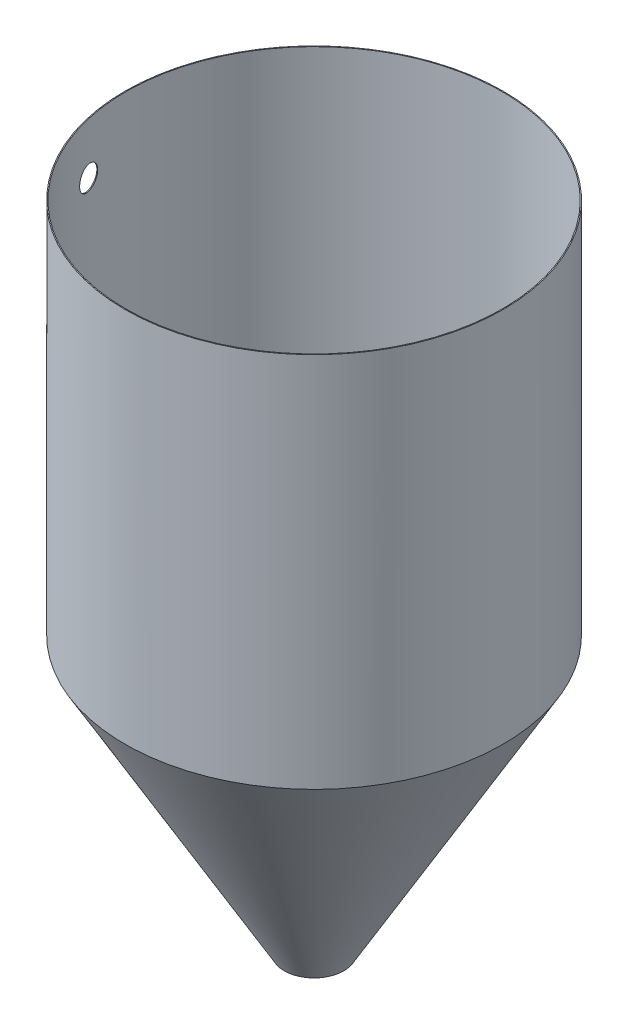
ISO-10303-21;
HEADER;
FILE_DESCRIPTION(('STEP AP214'),'2;1');
FILE_NAME('part.step','',(''),(''),'','','');
FILE_SCHEMA(('AUTOMOTIVE_DESIGN { 1 0 10303 214 1 1 1 1 }'));
ENDSEC;
DATA;
#1=APPLICATION_CONTEXT('core data for automotive mechanical design processes');
#2=APPLICATION_PROTOCOL_DEFINITION('international standard','automotive_design',2000,#1);
#3=PRODUCT_CONTEXT('',#1,'mechanical');
#4=PRODUCT('Part','Part','',(#3));
#5=PRODUCT_RELATED_PRODUCT_CATEGORY('part','',(#4));
#6=PRODUCT_DEFINITION_FORMATION('','',#4);
#7=PRODUCT_DEFINITION_CONTEXT('part definition',#1,'design');
#8=PRODUCT_DEFINITION('design','',#6,#7);
#9=PRODUCT_DEFINITION_SHAPE('','',#8);
#10=(LENGTH_UNIT() NAMED_UNIT(*) SI_UNIT(.MILLI.,.METRE.));
#11=(NAMED_UNIT(*) PLANE_ANGLE_UNIT() SI_UNIT($,.RADIAN.));
#12=(NAMED_UNIT(*) SI_UNIT($,.STERADIAN.) SOLID_ANGLE_UNIT());
#13=UNCERTAINTY_MEASURE_WITH_UNIT(LENGTH_MEASURE(1.E-05),#10,'distance_accuracy_value','');
#14=(GEOMETRIC_REPRESENTATION_CONTEXT(3) GLOBAL_UNCERTAINTY_ASSIGNED_CONTEXT((#13)) GLOBAL_UNIT_ASSIGNED_CONTEXT((#10,
#11,#12)) REPRESENTATION_CONTEXT('',''));
#15=CARTESIAN_POINT('',(0.,0.,0.));
#16=DIRECTION('',(0.,0.,1.));
#17=DIRECTION('',(1.,0.,0.));
#18=AXIS2_PLACEMENT_3D('',#15,#16,#17);
#19=CARTESIAN_POINT('',(0.,508.,0.));
#20=DIRECTION('',(0.,1.,0.));
#21=DIRECTION('',(0.,0.,1.));
#22=AXIS2_PLACEMENT_3D('',#19,#20,#21);
#23=PLANE('',#22);
#24=CARTESIAN_POINT('',(0.,508.,0.));
#25=DIRECTION('',(0.,1.,0.));
#26=DIRECTION('',(0.,0.,1.));
#27=AXIS2_PLACEMENT_3D('',#24,#25,#26);
#28=CIRCLE('',#27,255.21412);
#29=CARTESIAN_POINT('',(0.,508.,255.21412));
#30=VERTEX_POINT('',#29);
#31=EDGE_CURVE('E10',#30,#30,#28,.T.);
#32=ORIENTED_EDGE('',*,*,#31,.T.);
#33=EDGE_LOOP('',(#32));
#34=FACE_BOUND('',#33,.T.);
#35=CARTESIAN_POINT('',(0.,508.,0.));
#36=DIRECTION('',(0.,1.,0.));
#37=DIRECTION('',(0.,0.,1.));
#38=AXIS2_PLACEMENT_3D('',#35,#36,#37);
#39=CIRCLE('',#38,254.);
#40=CARTESIAN_POINT('',(0.,508.,254.));
#41=VERTEX_POINT('',#40);
#42=EDGE_CURVE('E45',#41,#41,#39,.T.);
#43=ORIENTED_EDGE('',*,*,#42,.F.);
#44=EDGE_LOOP('',(#43));
#45=FACE_BOUND('',#44,.T.);
#46=ADVANCED_FACE('F32',(#34,#45),#23,.T.);
#47=CARTESIAN_POINT('',(0.,508.,0.));
#48=DIRECTION('',(0.,-1.,0.));
#49=DIRECTION('',(0.,0.,-1.));
#50=AXIS2_PLACEMENT_3D('',#47,#48,#49);
#51=CYLINDRICAL_SURFACE('',#50,255.21412);
#52=CARTESIAN_POINT('',(-251.85436550192,438.955800527484,41.2749999999982));
#53=CARTESIAN_POINT('',(-251.854365706836,439.396988773429,41.2749963903755));
#54=CARTESIAN_POINT('',(-251.851351997081,439.838120880812,41.2933999942924));
#55=CARTESIAN_POINT('',(-251.839294482292,440.717381843675,41.366873648681));
#56=CARTESIAN_POINT('',(-251.830249127135,441.155509897869,41.4219531247799));
#57=CARTESIAN_POINT('',(-251.806109775557,442.025942254381,41.5684449986926));
#58=CARTESIAN_POINT('',(-251.791009478479,442.458240003938,41.6598952424156));
#59=CARTESIAN_POINT('',(-251.754755714358,443.31347619577,41.8784225878516));
#60=CARTESIAN_POINT('',(-251.733602252212,443.736414645617,42.0054996607384));
#61=CARTESIAN_POINT('',(-251.685256719372,444.569652603928,42.2942074638002));
#62=CARTESIAN_POINT('',(-251.658068703428,444.979960389407,42.4558149894848));
#63=CARTESIAN_POINT('',(-251.597651353186,445.785353594374,42.8123996030711));
#64=CARTESIAN_POINT('',(-251.564421931942,446.180438794684,43.007377171225));
#65=CARTESIAN_POINT('',(-251.491949764181,446.952528174313,43.4291607372981));
#66=CARTESIAN_POINT('',(-251.452708524765,447.329536854211,43.6559587569664));
#67=CARTESIAN_POINT('',(-251.368244219134,448.06297915449,44.1396998556211));
#68=CARTESIAN_POINT('',(-251.323021153745,448.419412777706,44.3966429304508));
#69=CARTESIAN_POINT('',(-251.226445745128,449.110784629897,44.9399201909252));
#70=CARTESIAN_POINT('',(-251.175067578278,449.445622536398,45.226377446369));
#71=CARTESIAN_POINT('',(-251.066435529356,450.089842065177,45.8255898343259));
#72=CARTESIAN_POINT('',(-251.009181635539,450.399223636564,46.1383450194102));
#73=CARTESIAN_POINT('',(-250.888927640438,450.990507387284,46.7878412552311));
#74=CARTESIAN_POINT('',(-250.825927175589,451.272407825649,47.1245838232661));
#75=CARTESIAN_POINT('',(-250.694359883361,451.806894985451,47.8195569006754));
#76=CARTESIAN_POINT('',(-250.625793006625,452.059481446919,48.1777876005734));
#77=CARTESIAN_POINT('',(-250.482424581402,452.536737574496,48.917745131333));
#78=CARTESIAN_POINT('',(-250.407555665985,452.761017699249,49.2997101633119));
#79=CARTESIAN_POINT('',(-250.252629844539,453.176526030377,50.0802014590353));
#80=CARTESIAN_POINT('',(-250.172572904496,453.367754020023,50.4787278313549));
#81=CARTESIAN_POINT('',(-250.007611075412,453.71604493981,51.2894977769892));
#82=CARTESIAN_POINT('',(-249.922705875292,453.873105674562,51.7017422297867));
#83=CARTESIAN_POINT('',(-249.748456090782,454.1521775431,52.5370129861681));
#84=CARTESIAN_POINT('',(-249.659111452128,454.27418824834,52.9600394215104));
#85=CARTESIAN_POINT('',(-249.474697032608,454.484529975382,53.8221196023577));
#86=CARTESIAN_POINT('',(-249.379550408639,454.572171764533,54.2613251396481));
#87=CARTESIAN_POINT('',(-249.185680578746,454.709995403622,55.1447927879756));
#88=CARTESIAN_POINT('',(-249.08695733101,454.760176815491,55.589054958084));
#89=CARTESIAN_POINT('',(-248.886540288326,454.822919435539,56.4796019369971));
#90=CARTESIAN_POINT('',(-248.784846216048,454.835477120084,56.9258869313285));
#91=CARTESIAN_POINT('',(-248.579170794266,454.823029190488,57.8174038218251));
#92=CARTESIAN_POINT('',(-248.475189418101,454.79802313826,58.2626357056475));
#93=CARTESIAN_POINT('',(-248.263534523634,454.709837363363,59.1580967557674));
#94=CARTESIAN_POINT('',(-248.155828944893,454.645890228901,59.6082429063362));
#95=CARTESIAN_POINT('',(-247.939631042617,454.479692561052,60.5012187079742));
#96=CARTESIAN_POINT('',(-247.831138707658,454.377441470404,60.9440482525005));
#97=CARTESIAN_POINT('',(-247.614245576609,454.135350374497,61.8193802633047));
#98=CARTESIAN_POINT('',(-247.505844789661,453.995506978686,62.2518817942379));
#99=CARTESIAN_POINT('',(-247.290080820086,453.679163283332,63.1035336830859));
#100=CARTESIAN_POINT('',(-247.182717640502,453.502662876306,63.5226840018496));
#101=CARTESIAN_POINT('',(-246.968960593356,453.112219010648,64.3487635767016));
#102=CARTESIAN_POINT('',(-246.862586642303,452.897924389814,64.7555321061239));
#103=CARTESIAN_POINT('',(-246.652938997588,452.434469528717,65.5495489225182));
#104=CARTESIAN_POINT('',(-246.549665337135,452.185308915142,65.9367970004231));
#105=CARTESIAN_POINT('',(-246.347292625393,451.65371237312,66.6889057158748));
#106=CARTESIAN_POINT('',(-246.248193565943,451.371276509728,67.0537663971878));
#107=CARTESIAN_POINT('',(-246.055261142584,450.774950825676,67.7583127038608));
#108=CARTESIAN_POINT('',(-245.961427697074,450.461061492664,68.0979987193804));
#109=CARTESIAN_POINT('',(-245.781284077783,449.808119000947,68.7453190705408));
#110=CARTESIAN_POINT('',(-245.694892721507,449.469441043633,69.0533091917192));
#111=CARTESIAN_POINT('',(-245.529341579419,448.7656816697,69.6396604389315));
#112=CARTESIAN_POINT('',(-245.450181769783,448.400600340078,69.9180216625819));
#113=CARTESIAN_POINT('',(-245.300108949716,447.646594741481,70.4427290808403));
#114=CARTESIAN_POINT('',(-245.229194639948,447.257674243909,70.6890803203505));
#115=CARTESIAN_POINT('',(-245.096545537434,446.458712386938,71.1476452094123));
#116=CARTESIAN_POINT('',(-245.034810453862,446.048671697247,71.3598599405315));
#117=CARTESIAN_POINT('',(-244.923347330034,445.225036296599,71.7414742885787));
#118=CARTESIAN_POINT('',(-244.87327742174,444.812056807092,71.9121024576505));
#119=CARTESIAN_POINT('',(-244.783173933696,443.972206266459,72.2182130054844));
#120=CARTESIAN_POINT('',(-244.743140136964,443.545335515889,72.3536961440866));
#121=CARTESIAN_POINT('',(-244.673677985469,442.680947582153,72.5882450889604));
#122=CARTESIAN_POINT('',(-244.644247520931,442.243432535428,72.6873181399274));
#123=CARTESIAN_POINT('',(-244.596406230554,441.361003425618,72.8481445704702));
#124=CARTESIAN_POINT('',(-244.577995139464,440.916089540898,72.9098988483607));
#125=CARTESIAN_POINT('',(-244.552916796164,440.038236745281,72.9939708127252));
#126=CARTESIAN_POINT('',(-244.54585470148,439.605435571376,73.0176144969915));
#127=CARTESIAN_POINT('',(-244.542326261232,438.739312833481,73.0294307729804));
#128=CARTESIAN_POINT('',(-244.545859631715,438.305991283748,73.0176043152894));
#129=CARTESIAN_POINT('',(-244.563472206201,437.44201815465,72.9585913419699));
#130=CARTESIAN_POINT('',(-244.577550528894,437.011366355189,72.9114077813654));
#131=CARTESIAN_POINT('',(-244.616058575711,436.155809785239,72.782109578594));
#132=CARTESIAN_POINT('',(-244.640488310445,435.73090502064,72.6999949006252));
#133=CARTESIAN_POINT('',(-244.69904230245,434.894528725653,72.5026633768333));
#134=CARTESIAN_POINT('',(-244.733056333971,434.482960593269,72.3878227401345));
#135=CARTESIAN_POINT('',(-244.810443863185,433.671214971111,72.1256700701219));
#136=CARTESIAN_POINT('',(-244.853817249397,433.271037345725,71.9783584235789));
#137=CARTESIAN_POINT('',(-244.949381720773,432.484697364654,71.652468591954));
#138=CARTESIAN_POINT('',(-245.001573242916,432.098535704679,71.4738888573747));
#139=CARTESIAN_POINT('',(-245.114141029556,431.342714697548,71.086886998693));
#140=CARTESIAN_POINT('',(-245.174517450141,430.973055665283,70.8784643054689));
#141=CARTESIAN_POINT('',(-245.304079392715,430.24507621677,70.428769233776));
#142=CARTESIAN_POINT('',(-245.373421180523,429.887148011065,70.1869069872278));
#143=CARTESIAN_POINT('',(-245.519098303615,429.193084633966,69.6756058745638));
#144=CARTESIAN_POINT('',(-245.595433707108,428.85694967518,69.406166739483));
#145=CARTESIAN_POINT('',(-245.754266721187,428.208444107443,68.8416545050785));
#146=CARTESIAN_POINT('',(-245.83676504871,427.896076271894,68.5465784227419));
#147=CARTESIAN_POINT('',(-246.007056402701,427.296942634211,67.9328833639412));
#148=CARTESIAN_POINT('',(-246.094849725972,427.010178269473,67.6142630675224));
#149=CARTESIAN_POINT('',(-246.278216752956,426.453686929538,66.9433519347723));
#150=CARTESIAN_POINT('',(-246.373958525217,426.184994619036,66.5902484296144));
#151=CARTESIAN_POINT('',(-246.5692297313,425.678514112113,65.8635221509089));
#152=CARTESIAN_POINT('',(-246.668759251503,425.440726621016,65.4898989093259));
#153=CARTESIAN_POINT('',(-246.870665876029,424.997428908093,64.7246319018876));
#154=CARTESIAN_POINT('',(-246.973043390932,424.791923368842,64.3329855323669));
#155=CARTESIAN_POINT('',(-247.17970093999,424.414449545133,63.534342036962));
#156=CARTESIAN_POINT('',(-247.283980974289,424.242481263212,63.1273449099164));
#157=CARTESIAN_POINT('',(-247.496742212646,423.928400114125,62.2880621117281));
#158=CARTESIAN_POINT('',(-247.605254608224,423.787356644578,61.8553837627537));
#159=CARTESIAN_POINT('',(-247.822407592381,423.542918546629,60.979544966578));
#160=CARTESIAN_POINT('',(-247.931048183681,423.439524732035,60.5363842930192));
#161=CARTESIAN_POINT('',(-248.147571486806,423.271116474231,59.6426126047062));
#162=CARTESIAN_POINT('',(-248.255454148037,423.206104569548,59.1920010991899));
#163=CARTESIAN_POINT('',(-248.469614835696,423.114995633576,58.2864821758472));
#164=CARTESIAN_POINT('',(-248.575892864015,423.088898556434,57.8315747630832));
#165=CARTESIAN_POINT('',(-248.78692399771,423.075870090271,56.9169180691366));
#166=CARTESIAN_POINT('',(-248.891657523575,423.089260753927,56.4571596158953));
#167=CARTESIAN_POINT('',(-249.097963933337,423.155975947014,55.5398274449165));
#168=CARTESIAN_POINT('',(-249.199536788539,423.20930083888,55.0822537470455));
#169=CARTESIAN_POINT('',(-249.398847810673,423.35569373298,54.1726732108731));
#170=CARTESIAN_POINT('',(-249.496586107572,423.448760386932,53.720666184252));
#171=CARTESIAN_POINT('',(-249.687630470462,423.674172965975,52.8255965792658));
#172=CARTESIAN_POINT('',(-249.780936598595,423.806518340149,52.3825338755424));
#173=CARTESIAN_POINT('',(-249.961427407807,424.107795419031,51.514327667686));
#174=CARTESIAN_POINT('',(-250.048675072726,424.276238027871,51.0890275362835));
#175=CARTESIAN_POINT('',(-250.217896880437,424.649656637101,50.2536839713973));
#176=CARTESIAN_POINT('',(-250.299871051251,424.854632443339,49.8436404568478));
#177=CARTESIAN_POINT('',(-250.458164091441,425.29978303131,49.0420431889644));
#178=CARTESIAN_POINT('',(-250.534483646244,425.539953536356,48.6504871967503));
#179=CARTESIAN_POINT('',(-250.681171202603,426.053905487473,47.8889116202168));
#180=CARTESIAN_POINT('',(-250.751539306132,426.327686357464,47.518891666931));
#181=CARTESIAN_POINT('',(-250.884649619613,426.900802148518,46.8109668497981));
#182=CARTESIAN_POINT('',(-250.947522148145,427.199470064225,46.4725464720937));
#183=CARTESIAN_POINT('',(-251.067155246354,427.825125524121,45.821829683749));
#184=CARTESIAN_POINT('',(-251.123915871849,428.152112809627,45.5095330345341));
#185=CARTESIAN_POINT('',(-251.231212751521,428.832238346256,44.9134338239329));
#186=CARTESIAN_POINT('',(-251.281747908691,429.185381188813,44.6296362860744));
#187=CARTESIAN_POINT('',(-251.352786387601,429.732603651443,44.2271679903637));
#188=CARTESIAN_POINT('',(-251.375672611249,429.917936493924,44.0968787501223));
#189=CARTESIAN_POINT('',(-251.419861501635,430.294187473022,43.8442326008069));
#190=CARTESIAN_POINT('',(-251.441163750882,430.485107063801,43.7218777841038));
#191=CARTESIAN_POINT('',(-251.501946216212,431.058793969602,43.3713468051944));
#192=CARTESIAN_POINT('',(-251.539150380903,431.449054606288,43.1548826882087));
#193=CARTESIAN_POINT('',(-251.607357143296,432.246794540017,42.7554202780057));
#194=CARTESIAN_POINT('',(-251.638359802788,432.654273665447,42.5724216513419));
#195=CARTESIAN_POINT('',(-251.694127252407,433.483130064592,42.2414667414146));
#196=CARTESIAN_POINT('',(-251.718898980706,433.904491283695,42.0934714927901));
#197=CARTESIAN_POINT('',(-251.762239081318,434.758330156071,41.8334717691992));
#198=CARTESIAN_POINT('',(-251.780809108453,435.190804810683,41.7214576935568));
#199=CARTESIAN_POINT('',(-251.815648125195,436.17357840181,41.5107302535892));
#200=CARTESIAN_POINT('',(-251.830169170723,436.726201024453,41.4224150787831));
#201=CARTESIAN_POINT('',(-251.849527701157,437.837845999167,41.3045524091586));
#202=CARTESIAN_POINT('',(-251.854365242316,438.396868314043,41.2750045729542));
#203=CARTESIAN_POINT('',(-251.85436550192,438.955800527484,41.2749999999982));
#204=B_SPLINE_CURVE_WITH_KNOTS('',3,(#52,#53,#54,#55,#56,#57,#58,#59,#60,#61,#62,#63,#64,#65,
#66,#67,#68,#69,#70,#71,#72,#73,#74,#75,#76,#77,#78,#79,#80,#81,#82,#83,#84,#85,#86,#87,#88,#89,
#90,#91,#92,#93,#94,#95,#96,#97,#98,#99,#100,#101,#102,#103,#104,#105,#106,#107,#108,#109,#110,
#111,#112,#113,#114,#115,#116,#117,#118,#119,#120,#121,#122,#123,#124,#125,#126,#127,#128,#129,
#130,#131,#132,#133,#134,#135,#136,#137,#138,#139,#140,#141,#142,#143,#144,#145,#146,#147,#148,
#149,#150,#151,#152,#153,#154,#155,#156,#157,#158,#159,#160,#161,#162,#163,#164,#165,#166,#167,
#168,#169,#170,#171,#172,#173,#174,#175,#176,#177,#178,#179,#180,#181,#182,#183,#184,#185,#186,
#187,#188,#189,#190,#191,#192,#193,#194,#195,#196,#197,#198,#199,#200,#201,#202,#203),
.UNSPECIFIED.,.T.,.F.,(4,2,2,2,2,2,2,2,2,2,2,2,2,2,2,2,2,2,2,2,2,2,2,2,2,2,2,2,2,2,2,2,2,2,2,2,
2,2,2,2,2,2,2,2,2,2,2,2,2,2,2,2,2,2,2,2,2,2,2,2,2,2,2,2,2,2,2,2,2,2,2,2,2,2,2,4),(0.,
1.32307441651123,2.64648899185604,3.97128427556441,5.29607848735963,6.61998522075084,
7.94391100903514,9.26750544441818,10.591099697288,11.9204555075634,13.2498139753736,
14.5792566052439,15.9087110242995,17.2548269081238,18.600951618392,19.9471627972537,
21.2933904350388,22.6653815754948,24.0373887600214,25.4095244352798,26.7816761131934,
28.1817855398384,29.5819153366401,30.9821714573461,32.382431683792,33.7964627352259,
35.2105089279384,36.6245523561833,38.0385738648585,39.4344245147297,40.8302705656262,
42.2258963580441,43.6214779232951,44.9687126051505,46.315918157192,47.6628555037603,
49.0097604263861,50.3087032314399,51.6076112256251,52.9064106736898,54.2052114529312,
55.4896454652637,56.7740641791906,58.0585465608114,59.3430534414869,60.6541064920105,
61.9651723308255,63.2763909248592,64.5876830853368,65.9478931880653,67.30813432877,
68.6685725939392,70.0290109620309,71.4309033774619,72.8328260933482,74.2348415201078,
75.6368552949356,77.0503351037593,78.4638277412662,79.8772724283762,81.2906972916999,
82.6860618809063,84.081419054808,85.4766068121408,86.8717706593615,88.2372740482222,
89.6027649652801,90.9684961559707,91.6514132781323,92.3345097647381,93.6762161752521,
95.0179092164232,96.3581015956609,97.6979360804644,99.374121280071,101.050296742504),.UNSPECIFIED.);
#205=CARTESIAN_POINT('',(-251.85436550192,438.955800527484,41.2749999999982));
#206=VERTEX_POINT('',#205);
#207=EDGE_CURVE('E63',#206,#206,#204,.T.);
#208=ORIENTED_EDGE('',*,*,#207,.T.);
#209=EDGE_LOOP('',(#208));
#210=FACE_BOUND('',#209,.T.);
#211=ORIENTED_EDGE('',*,*,#31,.F.);
#212=EDGE_LOOP('',(#211));
#213=FACE_BOUND('',#212,.T.);
#214=CARTESIAN_POINT('',(0.,0.,0.));
#215=DIRECTION('',(0.,-1.,0.));
#216=DIRECTION('',(0.,0.,-1.));
#217=AXIS2_PLACEMENT_3D('',#214,#215,#216);
#218=CIRCLE('',#217,255.21412);
#219=CARTESIAN_POINT('',(0.,0.,-255.21412));
#220=VERTEX_POINT('',#219);
#221=EDGE_CURVE('E60',#220,#220,#218,.T.);
#222=ORIENTED_EDGE('',*,*,#221,.F.);
#223=EDGE_LOOP('',(#222));
#224=FACE_BOUND('',#223,.T.);
#225=ADVANCED_FACE('F34',(#210,#213,#224),#51,.T.);
#226=CARTESIAN_POINT('',(0.,508.,0.));
#227=DIRECTION('',(0.,-1.,0.));
#228=DIRECTION('',(0.,0.,-1.));
#229=AXIS2_PLACEMENT_3D('',#226,#227,#228);
#230=CYLINDRICAL_SURFACE('',#229,254.);
#231=CARTESIAN_POINT('',(-250.623970072697,438.955800527484,41.2749999999982));
#232=CARTESIAN_POINT('',(-250.623970278986,439.396942240713,41.2749963873867));
#233=CARTESIAN_POINT('',(-250.620942411298,439.838027795462,41.2933961197146));
#234=CARTESIAN_POINT('',(-250.60882826958,440.717195826488,41.3668542019309));
#235=CARTESIAN_POINT('',(-250.599740438343,441.155277501629,41.4219219742635));
#236=CARTESIAN_POINT('',(-250.575487787281,442.025617373961,41.5683823567265));
#237=CARTESIAN_POINT('',(-250.560316638587,442.457869020189,41.6598127964913));
#238=CARTESIAN_POINT('',(-250.523892882693,443.313013757395,41.878292092759));
#239=CARTESIAN_POINT('',(-250.502640280243,443.735906855682,42.0053409214423));
#240=CARTESIAN_POINT('',(-250.454068401693,444.569054557481,42.2939830770273));
#241=CARTESIAN_POINT('',(-250.426753210307,444.979317459747,42.4555531422662));
#242=CARTESIAN_POINT('',(-250.366053547768,445.784622730123,42.8120532471188));
#243=CARTESIAN_POINT('',(-250.332668989334,446.179664879249,43.0069837664748));
#244=CARTESIAN_POINT('',(-250.259858877291,446.951670827452,43.4286630714157));
#245=CARTESIAN_POINT('',(-250.220434837554,447.328639125965,43.6554038821514));
#246=CARTESIAN_POINT('',(-250.135577587602,448.062004355725,44.1390198018163));
#247=CARTESIAN_POINT('',(-250.090144378009,448.418401289105,44.3958949076208));
#248=CARTESIAN_POINT('',(-249.993118896251,449.109718439173,44.9390355181395));
#249=CARTESIAN_POINT('',(-249.941500443384,449.444537427611,45.2254251810303));
#250=CARTESIAN_POINT('',(-249.832360885692,450.088723552265,45.8244926235929));
#251=CARTESIAN_POINT('',(-249.774839769003,450.398090637319,46.1371704561033));
#252=CARTESIAN_POINT('',(-249.654025163863,450.989351485332,46.7865018385399));
#253=CARTESIAN_POINT('',(-249.590731308869,451.271243501396,47.1231569106124));
#254=CARTESIAN_POINT('',(-249.458552070563,451.805721643384,47.8179446127854));
#255=CARTESIAN_POINT('',(-249.389666637223,452.058307507057,48.1760774350395));
#256=CARTESIAN_POINT('',(-249.245624354983,452.535600758908,48.915871761443));
#257=CARTESIAN_POINT('',(-249.170399185337,452.759914985041,49.2977736278421));
#258=CARTESIAN_POINT('',(-249.014736396976,453.175495893089,50.0781323294567));
#259=CARTESIAN_POINT('',(-248.934298743755,453.366762356198,50.4765892742593));
#260=CARTESIAN_POINT('',(-248.768552617336,453.715136653832,51.2872144438963));
#261=CARTESIAN_POINT('',(-248.683243828767,453.87224227351,51.6993835557735));
#262=CARTESIAN_POINT('',(-248.508165894494,454.151412226458,52.5344981593221));
#263=CARTESIAN_POINT('',(-248.418396693801,454.27347612758,52.957443783823));
#264=CARTESIAN_POINT('',(-248.233088999325,454.483954760481,53.8194349349514));
#265=CARTESIAN_POINT('',(-248.137472547563,454.571673783336,54.2586336417033));
#266=CARTESIAN_POINT('',(-247.942644430094,454.709650821775,55.142086371623));
#267=CARTESIAN_POINT('',(-247.843432721962,454.759908395156,55.5863404544026));
#268=CARTESIAN_POINT('',(-247.642022765501,454.822803751549,56.4768711736161));
#269=CARTESIAN_POINT('',(-247.539824235829,454.835437979051,56.9231479972136));
#270=CARTESIAN_POINT('',(-247.333126976988,454.823144561011,57.8146494276847));
#271=CARTESIAN_POINT('',(-247.228628220759,454.798216473358,58.2598740221119));
#272=CARTESIAN_POINT('',(-247.015896813043,454.71018144849,59.1554127228435));
#273=CARTESIAN_POINT('',(-246.90763157556,454.646299444102,59.6056430365351));
#274=CARTESIAN_POINT('',(-246.690307552464,454.480219100237,60.4987885576779));
#275=CARTESIAN_POINT('',(-246.581248755219,454.378020197972,60.9417036575853));
#276=CARTESIAN_POINT('',(-246.363220071918,454.136020229695,61.817209064766));
#277=CARTESIAN_POINT('',(-246.254250194875,453.996215735847,62.2497984269086));
#278=CARTESIAN_POINT('',(-246.037350205962,453.679935844496,63.1016282693302));
#279=CARTESIAN_POINT('',(-245.929420097186,453.503460337928,63.5208687099029));
#280=CARTESIAN_POINT('',(-245.714518843512,453.113029394329,64.3471778105948));
#281=CARTESIAN_POINT('',(-245.607567913138,452.898718640387,64.7540839383051));
#282=CARTESIAN_POINT('',(-245.396779875203,452.435206371691,65.548373647678));
#283=CARTESIAN_POINT('',(-245.292942801366,452.186004479212,65.9357570179284));
#284=CARTESIAN_POINT('',(-245.089463101526,451.654298535887,66.6881321615726));
#285=CARTESIAN_POINT('',(-244.989820468109,451.371794543918,67.0531239745523));
#286=CARTESIAN_POINT('',(-244.795827467805,450.775304176333,67.7579255577402));
#287=CARTESIAN_POINT('',(-244.701477018093,450.461318293638,68.0977357220805));
#288=CARTESIAN_POINT('',(-244.520349549479,449.808190821325,68.7452561634356));
#289=CARTESIAN_POINT('',(-244.433490219913,449.46942802785,69.0533254083409));
#290=CARTESIAN_POINT('',(-244.267041208561,448.765475062825,69.639827203925));
#291=CARTESIAN_POINT('',(-244.187451502752,448.400284978611,69.9182598525384));
#292=CARTESIAN_POINT('',(-244.036564027361,447.646038260912,70.4430975813573));
#293=CARTESIAN_POINT('',(-243.96526493634,447.256985446037,70.6895077663462));
#294=CARTESIAN_POINT('',(-243.831897963649,446.457735641507,71.1481736399929));
#295=CARTESIAN_POINT('',(-243.769829786074,446.047539330193,71.3604304234857));
#296=CARTESIAN_POINT('',(-243.657788716892,445.223721629347,71.7420390492413));
#297=CARTESIAN_POINT('',(-243.607468629764,444.810722168731,71.9126321664092));
#298=CARTESIAN_POINT('',(-243.516916727073,443.970824575504,72.2186732142291));
#299=CARTESIAN_POINT('',(-243.476684691202,443.543926746642,72.3541219123844));
#300=CARTESIAN_POINT('',(-243.40688194769,442.679480045197,72.5885996606024));
#301=CARTESIAN_POINT('',(-243.377309095632,442.241933333887,72.6876360361835));
#302=CARTESIAN_POINT('',(-243.32924167289,441.359437974805,72.8483850686301));
#303=CARTESIAN_POINT('',(-243.310746832485,440.914489507519,72.9100986342134));
#304=CARTESIAN_POINT('',(-243.285567957409,440.036730273473,72.99407004006));
#305=CARTESIAN_POINT('',(-243.27848302529,439.604058591263,73.0176672289928));
#306=CARTESIAN_POINT('',(-243.274957683165,438.738197808475,73.0294119433405));
#307=CARTESIAN_POINT('',(-243.278516984915,438.305008722225,73.0175604286961));
#308=CARTESIAN_POINT('',(-243.296229748636,437.441303535091,72.9585192596592));
#309=CARTESIAN_POINT('',(-243.310382317859,437.010787212042,72.9113325831375));
#310=CARTESIAN_POINT('',(-243.349085873839,436.15550380944,72.7820509982141));
#311=CARTESIAN_POINT('',(-243.373636871457,435.730736735892,72.6999560533528));
#312=CARTESIAN_POINT('',(-243.432473588649,434.894680181543,72.5026982630425));
#313=CARTESIAN_POINT('',(-243.466647532762,434.483293163287,72.3879149455));
#314=CARTESIAN_POINT('',(-243.544394221159,433.671906719691,72.1259086485269));
#315=CARTESIAN_POINT('',(-243.587966852438,433.271907157497,71.9786860591317));
#316=CARTESIAN_POINT('',(-243.68396627171,432.48591692724,71.6530067893991));
#317=CARTESIAN_POINT('',(-243.736393502595,432.099926961086,71.4745485466924));
#318=CARTESIAN_POINT('',(-243.849465961782,431.344439373528,71.087822541848));
#319=CARTESIAN_POINT('',(-243.910111348212,430.974942069641,70.8795542061276));
#320=CARTESIAN_POINT('',(-244.040260445669,430.247200071152,70.430157734015));
#321=CARTESIAN_POINT('',(-244.109922644662,429.889351278927,70.1884344145816));
#322=CARTESIAN_POINT('',(-244.256270929672,429.195436345482,69.6774333792359));
#323=CARTESIAN_POINT('',(-244.332957084917,428.859370419007,69.4081553917453));
#324=CARTESIAN_POINT('',(-244.492518095997,428.21098821887,68.8439867779048));
#325=CARTESIAN_POINT('',(-244.57539367844,427.898674742334,68.5490931437465));
#326=CARTESIAN_POINT('',(-244.7464621359,427.299631319616,67.9357830236282));
#327=CARTESIAN_POINT('',(-244.834655310606,427.012902817613,67.6173652116651));
#328=CARTESIAN_POINT('',(-245.018889565929,426.456361060543,66.9467634945202));
#329=CARTESIAN_POINT('',(-245.115101132229,426.187591998285,66.5937594343751));
#330=CARTESIAN_POINT('',(-245.311330908109,425.680951997946,65.8672339039811));
#331=CARTESIAN_POINT('',(-245.411349205328,425.443081771778,65.4937119612795));
#332=CARTESIAN_POINT('',(-245.614248035134,424.999610037098,64.7286473121886));
#333=CARTESIAN_POINT('',(-245.717128983987,424.794013250716,64.3371019795023));
#334=CARTESIAN_POINT('',(-245.924803625454,424.41634690198,63.538658429024));
#335=CARTESIAN_POINT('',(-246.029597318605,424.244277349052,63.1317602069163));
#336=CARTESIAN_POINT('',(-246.243440244941,423.929931604401,62.2925462797522));
#337=CARTESIAN_POINT('',(-246.352521185065,423.788735401815,61.8598337240108));
#338=CARTESIAN_POINT('',(-246.570813604416,423.54400206867,60.9839126370364));
#339=CARTESIAN_POINT('',(-246.680025086442,423.44046576004,60.5407038769476));
#340=CARTESIAN_POINT('',(-246.89768796339,423.271783560499,59.6468211850092));
#341=CARTESIAN_POINT('',(-247.006139307018,423.206640236246,59.1961467561327));
#342=CARTESIAN_POINT('',(-247.221430629403,423.115281092388,58.2904870144377));
#343=CARTESIAN_POINT('',(-247.328270610063,423.089065226834,57.8355017067084));
#344=CARTESIAN_POINT('',(-247.540429041826,423.075812271999,56.9206315480562));
#345=CARTESIAN_POINT('',(-247.645727602352,423.089100989395,56.4607372960216));
#346=CARTESIAN_POINT('',(-247.853148379492,423.15563685433,55.5431193372635));
#347=CARTESIAN_POINT('',(-247.955270566958,423.208884368456,55.0853956504918));
#348=CARTESIAN_POINT('',(-248.155660548287,423.355149634341,54.1755032474705));
#349=CARTESIAN_POINT('',(-248.253928474117,423.448166023141,53.7233343413936));
#350=CARTESIAN_POINT('',(-248.446008783672,423.673507710621,52.8279318552563));
#351=CARTESIAN_POINT('',(-248.539821230513,423.805832452268,52.3846981486713));
#352=CARTESIAN_POINT('',(-248.72128067392,424.107081812552,51.5161996587168));
#353=CARTESIAN_POINT('',(-248.808991588957,424.275512320792,51.0907768426256));
#354=CARTESIAN_POINT('',(-248.979112419658,424.648930632825,50.2551826600038));
#355=CARTESIAN_POINT('',(-249.061522363746,424.853918240584,49.8450112117027));
#356=CARTESIAN_POINT('',(-249.220656937916,425.299117692682,49.0431568922644));
#357=CARTESIAN_POINT('',(-249.29738226205,425.539325226217,48.6514717662056));
#358=CARTESIAN_POINT('',(-249.44484938742,426.053377511892,47.8896405606534));
#359=CARTESIAN_POINT('',(-249.515591292234,426.327221681557,47.519494108345));
#360=CARTESIAN_POINT('',(-249.649393734674,426.900428109585,46.8114010562165));
#361=CARTESIAN_POINT('',(-249.712586576914,427.19911630397,46.4729337664704));
#362=CARTESIAN_POINT('',(-249.832829335986,427.824825232371,45.8221226580704));
#363=CARTESIAN_POINT('',(-249.889879309714,428.151845703913,45.5097785974593));
#364=CARTESIAN_POINT('',(-249.997722992984,428.832050402457,44.913587101093));
#365=CARTESIAN_POINT('',(-250.048515604857,429.185239202561,44.6297446667086));
#366=CARTESIAN_POINT('',(-250.119915667933,429.73253985938,44.2272129303629));
#367=CARTESIAN_POINT('',(-250.14291832351,429.917900306963,44.0969031955729));
#368=CARTESIAN_POINT('',(-250.187331874073,430.294209506175,43.8442176593664));
#369=CARTESIAN_POINT('',(-250.208742349295,430.485159713129,43.721843951291));
#370=CARTESIAN_POINT('',(-250.269825959797,431.058872334992,43.3713021880925));
#371=CARTESIAN_POINT('',(-250.307212331478,431.449128470519,43.1548431988013));
#372=CARTESIAN_POINT('',(-250.375753320864,432.246863059071,42.7553884713808));
#373=CARTESIAN_POINT('',(-250.406908001523,432.654341338063,42.5723923951974));
#374=CARTESIAN_POINT('',(-250.462948951381,433.483199226223,42.2414413581837));
#375=CARTESIAN_POINT('',(-250.487842196069,433.90456276922,42.0934474146551));
#376=CARTESIAN_POINT('',(-250.531394842795,434.758409090491,41.8334500439573));
#377=CARTESIAN_POINT('',(-250.550055908213,435.190888868581,41.7214370137231));
#378=CARTESIAN_POINT('',(-250.585064663344,436.173652143186,41.510717763453));
#379=CARTESIAN_POINT('',(-250.599656221413,436.726259341866,41.4224073460719));
#380=CARTESIAN_POINT('',(-250.619108766859,437.837874610508,41.3045509253057));
#381=CARTESIAN_POINT('',(-250.623969811333,438.396882642893,41.275004577106));
#382=CARTESIAN_POINT('',(-250.623970072697,438.955800527484,41.2749999999982));
#383=B_SPLINE_CURVE_WITH_KNOTS('',3,(#231,#232,#233,#234,#235,#236,#237,#238,#239,#240,#241,
#242,#243,#244,#245,#246,#247,#248,#249,#250,#251,#252,#253,#254,#255,#256,#257,#258,#259,#260,
#261,#262,#263,#264,#265,#266,#267,#268,#269,#270,#271,#272,#273,#274,#275,#276,#277,#278,#279,
#280,#281,#282,#283,#284,#285,#286,#287,#288,#289,#290,#291,#292,#293,#294,#295,#296,#297,#298,
#299,#300,#301,#302,#303,#304,#305,#306,#307,#308,#309,#310,#311,#312,#313,#314,#315,#316,#317,
#318,#319,#320,#321,#322,#323,#324,#325,#326,#327,#328,#329,#330,#331,#332,#333,#334,#335,#336,
#337,#338,#339,#340,#341,#342,#343,#344,#345,#346,#347,#348,#349,#350,#351,#352,#353,#354,#355,
#356,#357,#358,#359,#360,#361,#362,#363,#364,#365,#366,#367,#368,#369,#370,#371,#372,#373,#374,
#375,#376,#377,#378,#379,#380,#381,#382),.UNSPECIFIED.,.T.,.F.,(4,2,2,2,2,2,2,2,2,2,2,2,2,2,2,2,
2,2,2,2,2,2,2,2,2,2,2,2,2,2,2,2,2,2,2,2,2,2,2,2,2,2,2,2,2,2,2,2,2,2,2,2,2,2,2,2,2,2,2,2,2,2,2,2,
2,2,2,2,2,2,2,2,2,2,2,4),(0.,1.32293480778933,2.64620969627127,3.97086486037128,
5.29551898984932,6.61928331856636,7.94306668537202,9.26651877039163,10.5899707181704,
11.9192367583945,13.2485054704767,14.5778586438319,15.9072237122131,17.253408348438,
18.5996018972124,19.945882701519,21.2921801078945,22.6644895630046,24.0368152168762,
25.4092705552172,26.7817420475593,28.1824554716792,29.5831894699117,30.9840511916042,
32.3849170797573,33.7997159386302,35.2145301150951,36.6293417902347,38.0441313166743,
39.4405834451754,40.8370309589266,42.2332555876004,43.629435449428,44.9767681036918,
46.3240713316789,47.67110335746,49.0181025850352,50.316651259603,51.6151647701667,
52.9135688608204,54.2119743075903,55.4958796696037,56.7797695953462,58.0637237580602,
59.3477026289467,60.6584840743723,61.9692784400828,63.2802269288474,64.5912493691859,
65.9516620896969,67.3121061487419,68.6727490777565,70.0333923892466,71.4359139212045,
72.8384660614772,74.2411119549641,75.6437561928201,77.058000483276,78.4722577483108,
79.8864665477811,81.3006553076637,82.6966027351783,84.0925426772285,85.4883119031483,
86.8840569623774,88.249836904375,89.6156041949223,90.9816107284978,91.6646655055882,
92.3478997300389,93.6896321720983,95.0313510587566,96.3715685297957,97.7114280079824,
99.3875702561343,101.063702669023),.UNSPECIFIED.);
#384=CARTESIAN_POINT('',(-250.623970072697,438.955800527484,41.2749999999982));
#385=VERTEX_POINT('',#384);
#386=EDGE_CURVE('E37',#385,#385,#383,.T.);
#387=ORIENTED_EDGE('',*,*,#386,.F.);
#388=EDGE_LOOP('',(#387));
#389=FACE_BOUND('',#388,.T.);
#390=ORIENTED_EDGE('',*,*,#42,.T.);
#391=EDGE_LOOP('',(#390));
#392=FACE_BOUND('',#391,.T.);
#393=CARTESIAN_POINT('',(0.,0.,0.));
#394=DIRECTION('',(0.,1.,0.));
#395=DIRECTION('',(0.,0.,1.));
#396=AXIS2_PLACEMENT_3D('',#393,#394,#395);
#397=CIRCLE('',#396,254.);
#398=CARTESIAN_POINT('',(0.,0.,254.));
#399=VERTEX_POINT('',#398);
#400=EDGE_CURVE('E49',#399,#399,#397,.T.);
#401=ORIENTED_EDGE('',*,*,#400,.F.);
#402=EDGE_LOOP('',(#401));
#403=FACE_BOUND('',#402,.T.);
#404=ADVANCED_FACE('F83',(#389,#392,#403),#230,.F.);
#405=CARTESIAN_POINT('',(0.,0.,0.));
#406=DIRECTION('',(0.,1.,0.));
#407=DIRECTION('',(0.,0.,1.));
#408=AXIS2_PLACEMENT_3D('',#405,#406,#407);
#409=CONICAL_SURFACE('',#408,254.,0.523598775598299);
#410=CARTESIAN_POINT('',(0.,-372.409976186192,0.));
#411=DIRECTION('',(0.,-1.,0.));
#412=DIRECTION('',(0.,0.,-1.));
#413=AXIS2_PLACEMENT_3D('',#410,#411,#412);
#414=CIRCLE('',#413,38.989);
#415=CARTESIAN_POINT('',(0.,-372.409976186192,-38.989));
#416=VERTEX_POINT('',#415);
#417=EDGE_CURVE('E53',#416,#416,#414,.T.);
#418=ORIENTED_EDGE('',*,*,#417,.T.);
#419=EDGE_LOOP('',(#418));
#420=FACE_BOUND('',#419,.T.);
#421=ORIENTED_EDGE('',*,*,#400,.T.);
#422=EDGE_LOOP('',(#421));
#423=FACE_BOUND('',#422,.T.);
#424=ADVANCED_FACE('F80',(#420,#423),#409,.F.);
#425=CARTESIAN_POINT('',(38.989,-372.409976186192,0.));
#426=DIRECTION('',(0.,-1.,0.));
#427=DIRECTION('',(0.,0.,-1.));
#428=AXIS2_PLACEMENT_3D('',#425,#426,#427);
#429=PLANE('',#428);
#430=CARTESIAN_POINT('',(0.,-372.409976186192,0.));
#431=DIRECTION('',(0.,-1.,0.));
#432=DIRECTION('',(0.,0.,-1.));
#433=AXIS2_PLACEMENT_3D('',#430,#431,#432);
#434=CIRCLE('',#433,40.20312);
#435=CARTESIAN_POINT('',(0.,-372.409976186192,-40.20312));
#436=VERTEX_POINT('',#435);
#437=EDGE_CURVE('E57',#436,#436,#434,.T.);
#438=ORIENTED_EDGE('',*,*,#437,.T.);
#439=EDGE_LOOP('',(#438));
#440=FACE_BOUND('',#439,.T.);
#441=ORIENTED_EDGE('',*,*,#417,.F.);
#442=EDGE_LOOP('',(#441));
#443=FACE_BOUND('',#442,.T.);
#444=ADVANCED_FACE('F76',(#440,#443),#429,.T.);
#445=CARTESIAN_POINT('',(0.,-372.409976186192,0.));
#446=DIRECTION('',(0.,1.,0.));
#447=DIRECTION('',(0.,0.,1.));
#448=AXIS2_PLACEMENT_3D('',#445,#446,#447);
#449=CONICAL_SURFACE('',#448,40.20312,0.523598775598299);
#450=ORIENTED_EDGE('',*,*,#221,.T.);
#451=EDGE_LOOP('',(#450));
#452=FACE_BOUND('',#451,.T.);
#453=ORIENTED_EDGE('',*,*,#437,.F.);
#454=EDGE_LOOP('',(#453));
#455=FACE_BOUND('',#454,.T.);
#456=ADVANCED_FACE('F71',(#452,#455),#449,.T.);
#457=CARTESIAN_POINT('',(-304.8,438.955800527484,57.1499999999982));
#458=DIRECTION('',(1.,0.,0.));
#459=DIRECTION('',(0.,0.,-1.));
#460=AXIS2_PLACEMENT_3D('',#457,#458,#459);
#461=CYLINDRICAL_SURFACE('',#460,15.875);
#462=ORIENTED_EDGE('',*,*,#386,.T.);
#463=EDGE_LOOP('',(#462));
#464=FACE_BOUND('',#463,.T.);
#465=ORIENTED_EDGE('',*,*,#207,.F.);
#466=EDGE_LOOP('',(#465));
#467=FACE_BOUND('',#466,.T.);
#468=ADVANCED_FACE('F67',(#464,#467),#461,.F.);
#469=CLOSED_SHELL('',(#46,#225,#404,#424,#444,#456,#468));
#470=MANIFOLD_SOLID_BREP('B2',#469);
#471=ADVANCED_BREP_SHAPE_REPRESENTATION('',(#18,#470),#14);
#472=SHAPE_DEFINITION_REPRESENTATION(#9,#471);
ENDSEC;
END-ISO-10303-21;
